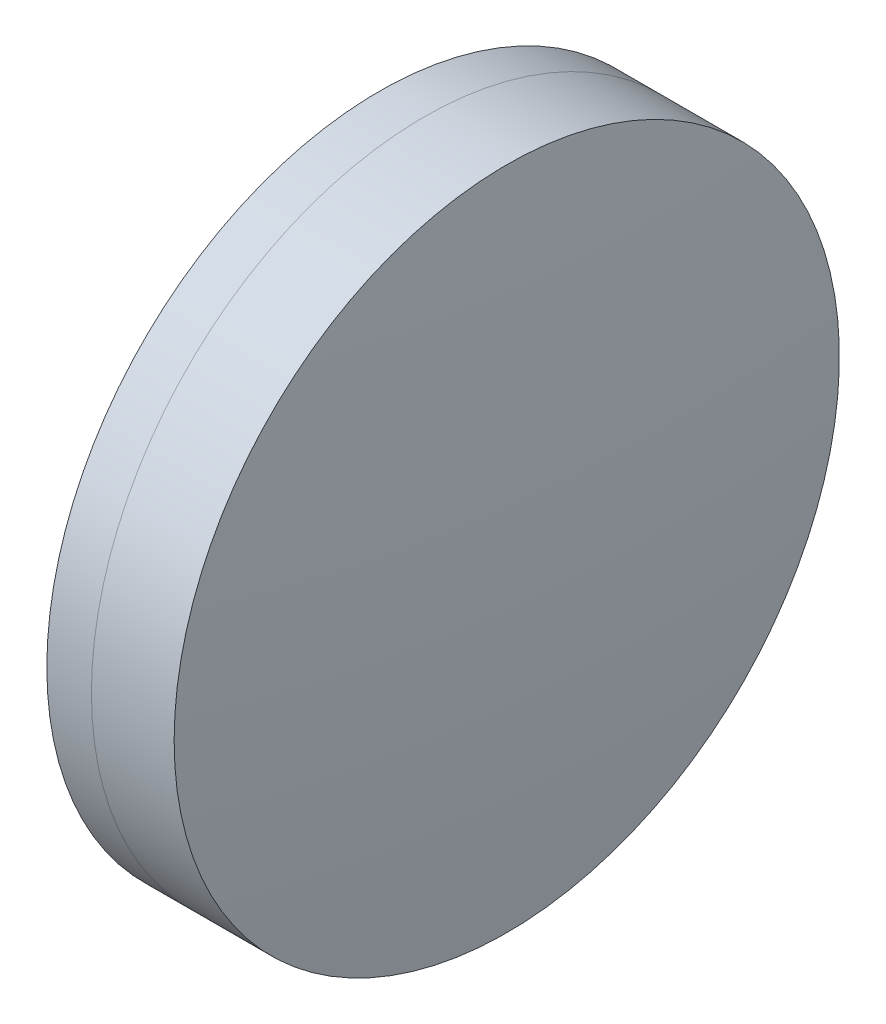
ISO-10303-21;
HEADER;
FILE_DESCRIPTION(('STEP AP214'),'2;1');
FILE_NAME('part.step','',(''),(''),'','','');
FILE_SCHEMA(('AUTOMOTIVE_DESIGN { 1 0 10303 214 1 1 1 1 }'));
ENDSEC;
DATA;
#1=APPLICATION_CONTEXT('core data for automotive mechanical design processes');
#2=APPLICATION_PROTOCOL_DEFINITION('international standard','automotive_design',2000,#1);
#3=PRODUCT_CONTEXT('',#1,'mechanical');
#4=PRODUCT('Part','Part','',(#3));
#5=PRODUCT_RELATED_PRODUCT_CATEGORY('part','',(#4));
#6=PRODUCT_DEFINITION_FORMATION('','',#4);
#7=PRODUCT_DEFINITION_CONTEXT('part definition',#1,'design');
#8=PRODUCT_DEFINITION('design','',#6,#7);
#9=PRODUCT_DEFINITION_SHAPE('','',#8);
#10=(LENGTH_UNIT() NAMED_UNIT(*) SI_UNIT(.MILLI.,.METRE.));
#11=(NAMED_UNIT(*) PLANE_ANGLE_UNIT() SI_UNIT($,.RADIAN.));
#12=(NAMED_UNIT(*) SI_UNIT($,.STERADIAN.) SOLID_ANGLE_UNIT());
#13=UNCERTAINTY_MEASURE_WITH_UNIT(LENGTH_MEASURE(1.E-05),#10,'distance_accuracy_value','');
#14=(GEOMETRIC_REPRESENTATION_CONTEXT(3) GLOBAL_UNCERTAINTY_ASSIGNED_CONTEXT((#13)) GLOBAL_UNIT_ASSIGNED_CONTEXT((#10,
#11,#12)) REPRESENTATION_CONTEXT('',''));
#15=CARTESIAN_POINT('',(0.,0.,0.));
#16=DIRECTION('',(0.,0.,1.));
#17=DIRECTION('',(1.,0.,0.));
#18=AXIS2_PLACEMENT_3D('',#15,#16,#17);
#19=CARTESIAN_POINT('',(265.857461954214,0.,0.));
#20=DIRECTION('',(-1.,0.,0.));
#21=DIRECTION('',(0.,0.,1.));
#22=AXIS2_PLACEMENT_3D('',#19,#20,#21);
#23=SPHERICAL_SURFACE('',#22,72.1);
#24=CARTESIAN_POINT('',(333.335236072808,0.,0.));
#25=DIRECTION('',(-1.,0.,0.));
#26=DIRECTION('',(0.,0.,1.));
#27=AXIS2_PLACEMENT_3D('',#24,#25,#26);
#28=CIRCLE('',#27,25.4000000000001);
#29=CARTESIAN_POINT('',(333.335236072808,0.,25.4000000000001));
#30=VERTEX_POINT('',#29);
#31=EDGE_CURVE('E11',#30,#30,#28,.T.);
#32=ORIENTED_EDGE('',*,*,#31,.T.);
#33=EDGE_LOOP('',(#32));
#34=FACE_BOUND('',#33,.T.);
#35=ADVANCED_FACE('F45',(#34),#23,.F.);
#36=CARTESIAN_POINT('',(-0.551919992657797,0.,0.));
#37=DIRECTION('',(-1.,0.,0.));
#38=DIRECTION('',(0.,0.,1.));
#39=AXIS2_PLACEMENT_3D('',#36,#37,#38);
#40=CYLINDRICAL_SURFACE('',#39,25.4);
#41=CARTESIAN_POINT('',(339.651719192487,0.,0.));
#42=DIRECTION('',(-1.,0.,0.));
#43=DIRECTION('',(0.,0.,1.));
#44=AXIS2_PLACEMENT_3D('',#41,#42,#43);
#45=CIRCLE('',#44,25.4);
#46=CARTESIAN_POINT('',(339.651719192487,0.,25.4));
#47=VERTEX_POINT('',#46);
#48=EDGE_CURVE('E51',#47,#47,#45,.T.);
#49=ORIENTED_EDGE('',*,*,#48,.T.);
#50=EDGE_LOOP('',(#49));
#51=FACE_BOUND('',#50,.T.);
#52=ORIENTED_EDGE('',*,*,#31,.F.);
#53=EDGE_LOOP('',(#52));
#54=FACE_BOUND('',#53,.T.);
#55=ADVANCED_FACE('F57',(#51,#54),#40,.T.);
#56=CARTESIAN_POINT('',(93.2574619542142,0.,0.));
#57=DIRECTION('',(-1.,0.,0.));
#58=DIRECTION('',(0.,0.,1.));
#59=AXIS2_PLACEMENT_3D('',#56,#57,#58);
#60=SPHERICAL_SURFACE('',#59,247.7);
#61=ORIENTED_EDGE('',*,*,#48,.F.);
#62=EDGE_LOOP('',(#61));
#63=FACE_BOUND('',#62,.T.);
#64=ADVANCED_FACE('F60',(#63),#60,.T.);
#65=CLOSED_SHELL('',(#35,#55,#64));
#66=MANIFOLD_SOLID_BREP('B2',#65);
#67=CARTESIAN_POINT('',(409.157461954214,0.,0.));
#68=DIRECTION('',(-1.,0.,0.));
#69=DIRECTION('',(0.,0.,-1.));
#70=AXIS2_PLACEMENT_3D('',#67,#68,#69);
#71=SPHERICAL_SURFACE('',#70,83.2);
#72=CARTESIAN_POINT('',(329.929436609643,0.,0.));
#73=DIRECTION('',(-1.,0.,0.));
#74=DIRECTION('',(0.,0.,1.));
#75=AXIS2_PLACEMENT_3D('',#72,#73,#74);
#76=CIRCLE('',#75,25.4);
#77=CARTESIAN_POINT('',(329.929436609643,0.,25.4));
#78=VERTEX_POINT('',#77);
#79=EDGE_CURVE('E44',#78,#78,#76,.T.);
#80=ORIENTED_EDGE('',*,*,#79,.T.);
#81=EDGE_LOOP('',(#80));
#82=FACE_BOUND('',#81,.T.);
#83=ADVANCED_FACE('F86',(#82),#71,.T.);
#84=CARTESIAN_POINT('',(124.523309526045,0.,0.));
#85=DIRECTION('',(-1.,0.,0.));
#86=DIRECTION('',(0.,0.,1.));
#87=AXIS2_PLACEMENT_3D('',#84,#85,#86);
#88=CYLINDRICAL_SURFACE('',#87,25.4);
#89=CARTESIAN_POINT('',(333.335236072808,0.,0.));
#90=DIRECTION('',(-1.,0.,0.));
#91=DIRECTION('',(0.,0.,1.));
#92=AXIS2_PLACEMENT_3D('',#89,#90,#91);
#93=CIRCLE('',#92,25.4);
#94=CARTESIAN_POINT('',(333.335236072808,0.,25.4));
#95=VERTEX_POINT('',#94);
#96=EDGE_CURVE('E92',#95,#95,#93,.T.);
#97=ORIENTED_EDGE('',*,*,#96,.T.);
#98=EDGE_LOOP('',(#97));
#99=FACE_BOUND('',#98,.T.);
#100=ORIENTED_EDGE('',*,*,#79,.F.);
#101=EDGE_LOOP('',(#100));
#102=FACE_BOUND('',#101,.T.);
#103=ADVANCED_FACE('F98',(#99,#102),#88,.T.);
#104=CARTESIAN_POINT('',(265.857461954214,0.,0.));
#105=DIRECTION('',(-1.,0.,0.));
#106=DIRECTION('',(0.,0.,1.));
#107=AXIS2_PLACEMENT_3D('',#104,#105,#106);
#108=SPHERICAL_SURFACE('',#107,72.1);
#109=ORIENTED_EDGE('',*,*,#96,.F.);
#110=EDGE_LOOP('',(#109));
#111=FACE_BOUND('',#110,.T.);
#112=ADVANCED_FACE('F101',(#111),#108,.T.);
#113=CLOSED_SHELL('',(#83,#103,#112));
#114=MANIFOLD_SOLID_BREP('B6',#113);
#115=ADVANCED_BREP_SHAPE_REPRESENTATION('',(#18,#66,#114),#14);
#116=SHAPE_DEFINITION_REPRESENTATION(#9,#115);
ENDSEC;
END-ISO-10303-21;
